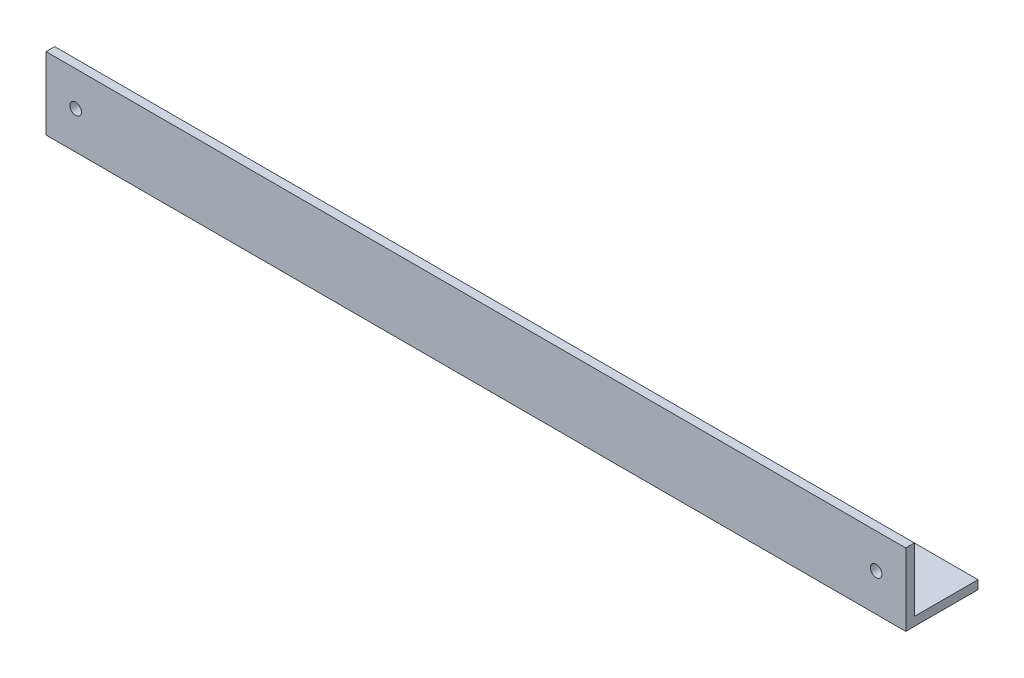
ISO-10303-21;
HEADER;
FILE_DESCRIPTION(('STEP AP214'),'2;1');
FILE_NAME('part.step','',(''),(''),'','','');
FILE_SCHEMA(('AUTOMOTIVE_DESIGN { 1 0 10303 214 1 1 1 1 }'));
ENDSEC;
DATA;
#1=APPLICATION_CONTEXT('core data for automotive mechanical design processes');
#2=APPLICATION_PROTOCOL_DEFINITION('international standard','automotive_design',2000,#1);
#3=PRODUCT_CONTEXT('',#1,'mechanical');
#4=PRODUCT('Part','Part','',(#3));
#5=PRODUCT_RELATED_PRODUCT_CATEGORY('part','',(#4));
#6=PRODUCT_DEFINITION_FORMATION('','',#4);
#7=PRODUCT_DEFINITION_CONTEXT('part definition',#1,'design');
#8=PRODUCT_DEFINITION('design','',#6,#7);
#9=PRODUCT_DEFINITION_SHAPE('','',#8);
#10=(LENGTH_UNIT() NAMED_UNIT(*) SI_UNIT(.MILLI.,.METRE.));
#11=(NAMED_UNIT(*) PLANE_ANGLE_UNIT() SI_UNIT($,.RADIAN.));
#12=(NAMED_UNIT(*) SI_UNIT($,.STERADIAN.) SOLID_ANGLE_UNIT());
#13=UNCERTAINTY_MEASURE_WITH_UNIT(LENGTH_MEASURE(1.E-05),#10,'distance_accuracy_value','');
#14=(GEOMETRIC_REPRESENTATION_CONTEXT(3) GLOBAL_UNCERTAINTY_ASSIGNED_CONTEXT((#13)) GLOBAL_UNIT_ASSIGNED_CONTEXT((#10,
#11,#12)) REPRESENTATION_CONTEXT('',''));
#15=CARTESIAN_POINT('',(0.,0.,0.));
#16=DIRECTION('',(0.,0.,1.));
#17=DIRECTION('',(1.,0.,0.));
#18=AXIS2_PLACEMENT_3D('',#15,#16,#17);
#19=CARTESIAN_POINT('',(595.,0.,0.));
#20=DIRECTION('',(0.,1.,0.));
#21=DIRECTION('',(0.,0.,1.));
#22=AXIS2_PLACEMENT_3D('',#19,#20,#21);
#23=PLANE('',#22);
#24=DIRECTION('',(0.,0.,-1.));
#25=VECTOR('',#24,1.);
#26=CARTESIAN_POINT('',(0.,0.,0.));
#27=LINE('',#26,#25);
#28=CARTESIAN_POINT('',(0.,0.,0.));
#29=VERTEX_POINT('',#28);
#30=CARTESIAN_POINT('',(0.,0.,-50.));
#31=VERTEX_POINT('',#30);
#32=EDGE_CURVE('E115',#29,#31,#27,.T.);
#33=ORIENTED_EDGE('',*,*,#32,.T.);
#34=DIRECTION('',(-1.,0.,0.));
#35=VECTOR('',#34,1.);
#36=CARTESIAN_POINT('',(595.,0.,-50.));
#37=LINE('',#36,#35);
#38=CARTESIAN_POINT('',(595.,0.,-50.));
#39=VERTEX_POINT('',#38);
#40=EDGE_CURVE('E11',#39,#31,#37,.T.);
#41=ORIENTED_EDGE('',*,*,#40,.F.);
#42=DIRECTION('',(0.,0.,-1.));
#43=VECTOR('',#42,1.);
#44=CARTESIAN_POINT('',(595.,0.,0.));
#45=LINE('',#44,#43);
#46=CARTESIAN_POINT('',(595.,0.,0.));
#47=VERTEX_POINT('',#46);
#48=EDGE_CURVE('E80',#47,#39,#45,.T.);
#49=ORIENTED_EDGE('',*,*,#48,.F.);
#50=DIRECTION('',(-1.,0.,0.));
#51=VECTOR('',#50,1.);
#52=CARTESIAN_POINT('',(595.,0.,0.));
#53=LINE('',#52,#51);
#54=EDGE_CURVE('E111',#47,#29,#53,.T.);
#55=ORIENTED_EDGE('',*,*,#54,.T.);
#56=EDGE_LOOP('',(#33,#41,#49,#55));
#57=FACE_BOUND('',#56,.T.);
#58=ADVANCED_FACE('F34',(#57),#23,.F.);
#59=CARTESIAN_POINT('',(595.,6.,-50.));
#60=DIRECTION('',(0.,0.,-1.));
#61=DIRECTION('',(-1.,0.,0.));
#62=AXIS2_PLACEMENT_3D('',#59,#60,#61);
#63=PLANE('',#62);
#64=DIRECTION('',(0.,-1.,0.));
#65=VECTOR('',#64,1.);
#66=CARTESIAN_POINT('',(0.,6.,-50.));
#67=LINE('',#66,#65);
#68=CARTESIAN_POINT('',(0.,6.,-50.));
#69=VERTEX_POINT('',#68);
#70=EDGE_CURVE('E118',#69,#31,#67,.T.);
#71=ORIENTED_EDGE('',*,*,#70,.F.);
#72=DIRECTION('',(-1.,0.,0.));
#73=VECTOR('',#72,1.);
#74=CARTESIAN_POINT('',(595.,6.,-50.));
#75=LINE('',#74,#73);
#76=CARTESIAN_POINT('',(595.,6.,-50.));
#77=VERTEX_POINT('',#76);
#78=EDGE_CURVE('E42',#77,#69,#75,.T.);
#79=ORIENTED_EDGE('',*,*,#78,.F.);
#80=DIRECTION('',(0.,-1.,0.));
#81=VECTOR('',#80,1.);
#82=CARTESIAN_POINT('',(595.,6.,-50.));
#83=LINE('',#82,#81);
#84=EDGE_CURVE('E182',#77,#39,#83,.T.);
#85=ORIENTED_EDGE('',*,*,#84,.T.);
#86=ORIENTED_EDGE('',*,*,#40,.T.);
#87=EDGE_LOOP('',(#71,#79,#85,#86));
#88=FACE_BOUND('',#87,.T.);
#89=ADVANCED_FACE('F137',(#88),#63,.T.);
#90=CARTESIAN_POINT('',(595.,6.,0.));
#91=DIRECTION('',(0.,1.,0.));
#92=DIRECTION('',(0.,0.,1.));
#93=AXIS2_PLACEMENT_3D('',#90,#91,#92);
#94=PLANE('',#93);
#95=DIRECTION('',(0.,0.,-1.));
#96=VECTOR('',#95,1.);
#97=CARTESIAN_POINT('',(0.,6.,0.));
#98=LINE('',#97,#96);
#99=CARTESIAN_POINT('',(0.,6.,-6.));
#100=VERTEX_POINT('',#99);
#101=EDGE_CURVE('E122',#100,#69,#98,.T.);
#102=ORIENTED_EDGE('',*,*,#101,.F.);
#103=DIRECTION('',(-1.,0.,0.));
#104=VECTOR('',#103,1.);
#105=CARTESIAN_POINT('',(595.,6.,-6.));
#106=LINE('',#105,#104);
#107=CARTESIAN_POINT('',(595.,6.,-6.));
#108=VERTEX_POINT('',#107);
#109=EDGE_CURVE('E101',#108,#100,#106,.T.);
#110=ORIENTED_EDGE('',*,*,#109,.F.);
#111=DIRECTION('',(0.,0.,-1.));
#112=VECTOR('',#111,1.);
#113=CARTESIAN_POINT('',(595.,6.,0.));
#114=LINE('',#113,#112);
#115=EDGE_CURVE('E107',#108,#77,#114,.T.);
#116=ORIENTED_EDGE('',*,*,#115,.T.);
#117=ORIENTED_EDGE('',*,*,#78,.T.);
#118=EDGE_LOOP('',(#102,#110,#116,#117));
#119=FACE_BOUND('',#118,.T.);
#120=ADVANCED_FACE('F134',(#119),#94,.T.);
#121=CARTESIAN_POINT('',(595.,50.,-6.));
#122=DIRECTION('',(0.,0.,-1.));
#123=DIRECTION('',(-1.,0.,0.));
#124=AXIS2_PLACEMENT_3D('',#121,#122,#123);
#125=PLANE('',#124);
#126=CARTESIAN_POINT('',(574.5,26.,-6.));
#127=DIRECTION('',(0.,0.,-1.));
#128=DIRECTION('',(-1.,0.,0.));
#129=AXIS2_PLACEMENT_3D('',#126,#127,#128);
#130=CIRCLE('',#129,3.99999999999999);
#131=CARTESIAN_POINT('',(570.5,26.,-6.));
#132=VERTEX_POINT('',#131);
#133=EDGE_CURVE('E171',#132,#132,#130,.T.);
#134=ORIENTED_EDGE('',*,*,#133,.F.);
#135=EDGE_LOOP('',(#134));
#136=FACE_BOUND('',#135,.T.);
#137=CARTESIAN_POINT('',(20.5,26.,-6.));
#138=DIRECTION('',(0.,0.,-1.));
#139=DIRECTION('',(-1.,0.,0.));
#140=AXIS2_PLACEMENT_3D('',#137,#138,#139);
#141=CIRCLE('',#140,4.);
#142=CARTESIAN_POINT('',(16.5,26.,-6.));
#143=VERTEX_POINT('',#142);
#144=EDGE_CURVE('E119',#143,#143,#141,.T.);
#145=ORIENTED_EDGE('',*,*,#144,.F.);
#146=EDGE_LOOP('',(#145));
#147=FACE_BOUND('',#146,.T.);
#148=DIRECTION('',(0.,1.,0.));
#149=VECTOR('',#148,1.);
#150=CARTESIAN_POINT('',(0.,50.,-6.));
#151=LINE('',#150,#149);
#152=CARTESIAN_POINT('',(0.,50.,-6.));
#153=VERTEX_POINT('',#152);
#154=EDGE_CURVE('E96',#153,#100,#151,.F.);
#155=ORIENTED_EDGE('',*,*,#154,.F.);
#156=DIRECTION('',(-1.,0.,0.));
#157=VECTOR('',#156,1.);
#158=CARTESIAN_POINT('',(595.,50.,-6.));
#159=LINE('',#158,#157);
#160=CARTESIAN_POINT('',(595.,50.,-6.));
#161=VERTEX_POINT('',#160);
#162=EDGE_CURVE('E91',#161,#153,#159,.T.);
#163=ORIENTED_EDGE('',*,*,#162,.F.);
#164=DIRECTION('',(0.,1.,0.));
#165=VECTOR('',#164,1.);
#166=CARTESIAN_POINT('',(595.,50.,-6.));
#167=LINE('',#166,#165);
#168=EDGE_CURVE('E94',#161,#108,#167,.F.);
#169=ORIENTED_EDGE('',*,*,#168,.T.);
#170=ORIENTED_EDGE('',*,*,#109,.T.);
#171=EDGE_LOOP('',(#155,#163,#169,#170));
#172=FACE_BOUND('',#171,.T.);
#173=ADVANCED_FACE('F93',(#136,#147,#172),#125,.T.);
#174=CARTESIAN_POINT('',(595.,50.,0.));
#175=DIRECTION('',(0.,1.,0.));
#176=DIRECTION('',(0.,0.,1.));
#177=AXIS2_PLACEMENT_3D('',#174,#175,#176);
#178=PLANE('',#177);
#179=DIRECTION('',(0.,0.,-1.));
#180=VECTOR('',#179,1.);
#181=CARTESIAN_POINT('',(0.,50.,0.));
#182=LINE('',#181,#180);
#183=CARTESIAN_POINT('',(0.,50.,0.));
#184=VERTEX_POINT('',#183);
#185=EDGE_CURVE('E126',#184,#153,#182,.T.);
#186=ORIENTED_EDGE('',*,*,#185,.F.);
#187=DIRECTION('',(-1.,0.,0.));
#188=VECTOR('',#187,1.);
#189=CARTESIAN_POINT('',(595.,50.,0.));
#190=LINE('',#189,#188);
#191=CARTESIAN_POINT('',(595.,50.,0.));
#192=VERTEX_POINT('',#191);
#193=EDGE_CURVE('E71',#192,#184,#190,.T.);
#194=ORIENTED_EDGE('',*,*,#193,.F.);
#195=DIRECTION('',(0.,0.,-1.));
#196=VECTOR('',#195,1.);
#197=CARTESIAN_POINT('',(595.,50.,0.));
#198=LINE('',#197,#196);
#199=EDGE_CURVE('E105',#192,#161,#198,.T.);
#200=ORIENTED_EDGE('',*,*,#199,.T.);
#201=ORIENTED_EDGE('',*,*,#162,.T.);
#202=EDGE_LOOP('',(#186,#194,#200,#201));
#203=FACE_BOUND('',#202,.T.);
#204=ADVANCED_FACE('F109',(#203),#178,.T.);
#205=CARTESIAN_POINT('',(595.,50.,0.));
#206=DIRECTION('',(0.,0.,-1.));
#207=DIRECTION('',(-1.,0.,0.));
#208=AXIS2_PLACEMENT_3D('',#205,#206,#207);
#209=PLANE('',#208);
#210=CARTESIAN_POINT('',(574.5,26.,0.));
#211=DIRECTION('',(0.,0.,1.));
#212=DIRECTION('',(-1.,0.,0.));
#213=AXIS2_PLACEMENT_3D('',#210,#211,#212);
#214=CIRCLE('',#213,3.99999999999999);
#215=CARTESIAN_POINT('',(570.5,26.,0.));
#216=VERTEX_POINT('',#215);
#217=EDGE_CURVE('E184',#216,#216,#214,.T.);
#218=ORIENTED_EDGE('',*,*,#217,.F.);
#219=EDGE_LOOP('',(#218));
#220=FACE_BOUND('',#219,.T.);
#221=CARTESIAN_POINT('',(20.5,26.,0.));
#222=DIRECTION('',(0.,0.,1.));
#223=DIRECTION('',(1.,0.,0.));
#224=AXIS2_PLACEMENT_3D('',#221,#222,#223);
#225=CIRCLE('',#224,4.);
#226=CARTESIAN_POINT('',(24.5,26.,0.));
#227=VERTEX_POINT('',#226);
#228=EDGE_CURVE('E175',#227,#227,#225,.T.);
#229=ORIENTED_EDGE('',*,*,#228,.F.);
#230=EDGE_LOOP('',(#229));
#231=FACE_BOUND('',#230,.T.);
#232=DIRECTION('',(0.,-1.,0.));
#233=VECTOR('',#232,1.);
#234=CARTESIAN_POINT('',(0.,50.,0.));
#235=LINE('',#234,#233);
#236=EDGE_CURVE('E74',#184,#29,#235,.T.);
#237=ORIENTED_EDGE('',*,*,#236,.T.);
#238=ORIENTED_EDGE('',*,*,#54,.F.);
#239=DIRECTION('',(0.,-1.,0.));
#240=VECTOR('',#239,1.);
#241=CARTESIAN_POINT('',(595.,50.,0.));
#242=LINE('',#241,#240);
#243=EDGE_CURVE('E50',#192,#47,#242,.T.);
#244=ORIENTED_EDGE('',*,*,#243,.F.);
#245=ORIENTED_EDGE('',*,*,#193,.T.);
#246=EDGE_LOOP('',(#237,#238,#244,#245));
#247=FACE_BOUND('',#246,.T.);
#248=ADVANCED_FACE('F142',(#220,#231,#247),#209,.F.);
#249=CARTESIAN_POINT('',(595.,0.,0.));
#250=DIRECTION('',(-1.,0.,0.));
#251=DIRECTION('',(0.,0.,1.));
#252=AXIS2_PLACEMENT_3D('',#249,#250,#251);
#253=PLANE('',#252);
#254=ORIENTED_EDGE('',*,*,#48,.T.);
#255=ORIENTED_EDGE('',*,*,#84,.F.);
#256=ORIENTED_EDGE('',*,*,#115,.F.);
#257=ORIENTED_EDGE('',*,*,#168,.F.);
#258=ORIENTED_EDGE('',*,*,#199,.F.);
#259=ORIENTED_EDGE('',*,*,#243,.T.);
#260=EDGE_LOOP('',(#254,#255,#256,#257,#258,#259));
#261=FACE_BOUND('',#260,.T.);
#262=ADVANCED_FACE('F104',(#261),#253,.F.);
#263=CARTESIAN_POINT('',(0.,0.,0.));
#264=DIRECTION('',(-1.,0.,0.));
#265=DIRECTION('',(0.,0.,1.));
#266=AXIS2_PLACEMENT_3D('',#263,#264,#265);
#267=PLANE('',#266);
#268=ORIENTED_EDGE('',*,*,#32,.F.);
#269=ORIENTED_EDGE('',*,*,#236,.F.);
#270=ORIENTED_EDGE('',*,*,#185,.T.);
#271=ORIENTED_EDGE('',*,*,#154,.T.);
#272=ORIENTED_EDGE('',*,*,#101,.T.);
#273=ORIENTED_EDGE('',*,*,#70,.T.);
#274=EDGE_LOOP('',(#268,#269,#270,#271,#272,#273));
#275=FACE_BOUND('',#274,.T.);
#276=ADVANCED_FACE('F140',(#275),#267,.T.);
#277=CARTESIAN_POINT('',(20.5,26.,-50.));
#278=DIRECTION('',(0.,0.,1.));
#279=DIRECTION('',(1.,0.,0.));
#280=AXIS2_PLACEMENT_3D('',#277,#278,#279);
#281=CYLINDRICAL_SURFACE('',#280,4.);
#282=ORIENTED_EDGE('',*,*,#144,.T.);
#283=EDGE_LOOP('',(#282));
#284=FACE_BOUND('',#283,.T.);
#285=ORIENTED_EDGE('',*,*,#228,.T.);
#286=EDGE_LOOP('',(#285));
#287=FACE_BOUND('',#286,.T.);
#288=ADVANCED_FACE('F189',(#284,#287),#281,.F.);
#289=CARTESIAN_POINT('',(574.5,26.,-50.));
#290=DIRECTION('',(0.,0.,1.));
#291=DIRECTION('',(1.,0.,0.));
#292=AXIS2_PLACEMENT_3D('',#289,#290,#291);
#293=CYLINDRICAL_SURFACE('',#292,3.99999999999999);
#294=ORIENTED_EDGE('',*,*,#133,.T.);
#295=EDGE_LOOP('',(#294));
#296=FACE_BOUND('',#295,.T.);
#297=ORIENTED_EDGE('',*,*,#217,.T.);
#298=EDGE_LOOP('',(#297));
#299=FACE_BOUND('',#298,.T.);
#300=ADVANCED_FACE('F187',(#296,#299),#293,.F.);
#301=CLOSED_SHELL('',(#58,#89,#120,#173,#204,#248,#262,#276,#288,#300));
#302=MANIFOLD_SOLID_BREP('B2',#301);
#303=ADVANCED_BREP_SHAPE_REPRESENTATION('',(#18,#302),#14);
#304=SHAPE_DEFINITION_REPRESENTATION(#9,#303);
ENDSEC;
END-ISO-10303-21;
